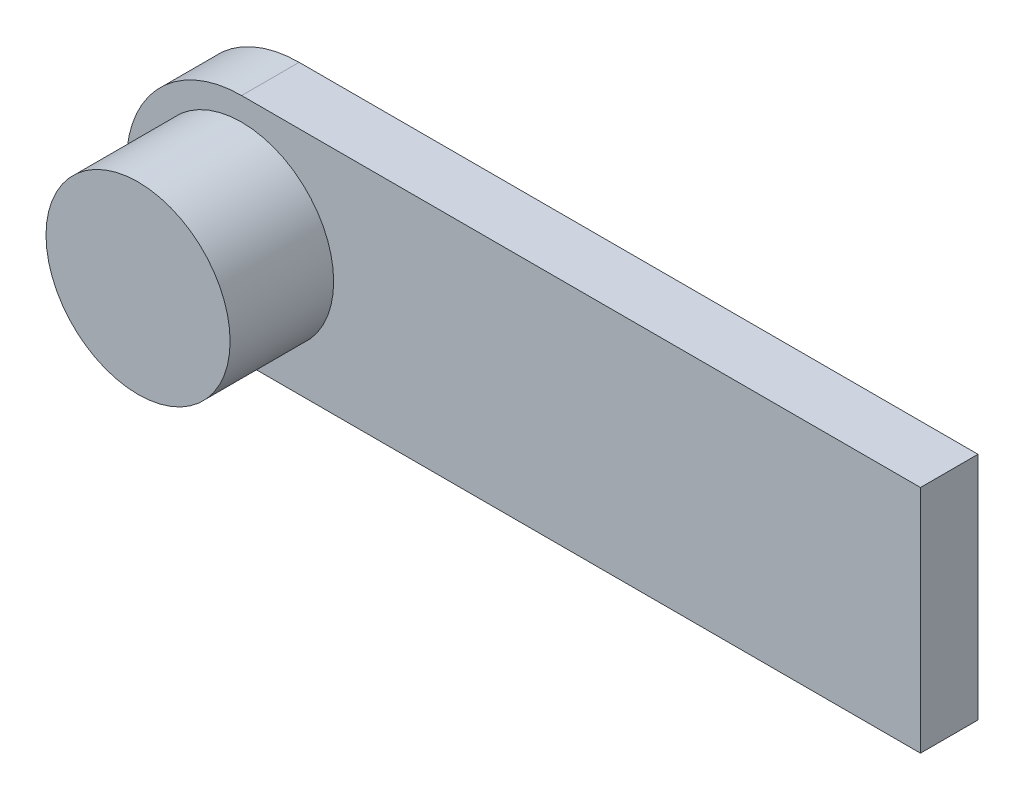
ISO-10303-21;
HEADER;
FILE_DESCRIPTION(('STEP AP214'),'2;1');
FILE_NAME('part.step','',(''),(''),'','','');
FILE_SCHEMA(('AUTOMOTIVE_DESIGN { 1 0 10303 214 1 1 1 1 }'));
ENDSEC;
DATA;
#1=APPLICATION_CONTEXT('core data for automotive mechanical design processes');
#2=APPLICATION_PROTOCOL_DEFINITION('international standard','automotive_design',2000,#1);
#3=PRODUCT_CONTEXT('',#1,'mechanical');
#4=PRODUCT('Part','Part','',(#3));
#5=PRODUCT_RELATED_PRODUCT_CATEGORY('part','',(#4));
#6=PRODUCT_DEFINITION_FORMATION('','',#4);
#7=PRODUCT_DEFINITION_CONTEXT('part definition',#1,'design');
#8=PRODUCT_DEFINITION('design','',#6,#7);
#9=PRODUCT_DEFINITION_SHAPE('','',#8);
#10=(LENGTH_UNIT() NAMED_UNIT(*) SI_UNIT(.MILLI.,.METRE.));
#11=(NAMED_UNIT(*) PLANE_ANGLE_UNIT() SI_UNIT($,.RADIAN.));
#12=(NAMED_UNIT(*) SI_UNIT($,.STERADIAN.) SOLID_ANGLE_UNIT());
#13=UNCERTAINTY_MEASURE_WITH_UNIT(LENGTH_MEASURE(1.E-05),#10,'distance_accuracy_value','');
#14=(GEOMETRIC_REPRESENTATION_CONTEXT(3) GLOBAL_UNCERTAINTY_ASSIGNED_CONTEXT((#13)) GLOBAL_UNIT_ASSIGNED_CONTEXT((#10,
#11,#12)) REPRESENTATION_CONTEXT('',''));
#15=CARTESIAN_POINT('',(0.,0.,0.));
#16=DIRECTION('',(0.,0.,1.));
#17=DIRECTION('',(1.,0.,0.));
#18=AXIS2_PLACEMENT_3D('',#15,#16,#17);
#19=CARTESIAN_POINT('',(0.,0.,0.25));
#20=DIRECTION('',(0.,0.,1.));
#21=DIRECTION('',(0.707106781186548,0.707106781186548,0.));
#22=AXIS2_PLACEMENT_3D('',#19,#20,#21);
#23=PLANE('',#22);
#24=DIRECTION('',(0.,1.,0.));
#25=VECTOR('',#24,1.);
#26=CARTESIAN_POINT('',(8.45,-0.5,0.25));
#27=LINE('',#26,#25);
#28=CARTESIAN_POINT('',(8.45,-0.5,0.25));
#29=VERTEX_POINT('',#28);
#30=CARTESIAN_POINT('',(8.45,0.5,0.25));
#31=VERTEX_POINT('',#30);
#32=EDGE_CURVE('E11',#29,#31,#27,.T.);
#33=ORIENTED_EDGE('',*,*,#32,.T.);
#34=DIRECTION('',(-1.,0.,0.));
#35=VECTOR('',#34,1.);
#36=CARTESIAN_POINT('',(8.45,0.5,0.25));
#37=LINE('',#36,#35);
#38=CARTESIAN_POINT('',(5.5,0.5,0.25));
#39=VERTEX_POINT('',#38);
#40=EDGE_CURVE('E26',#31,#39,#37,.T.);
#41=ORIENTED_EDGE('',*,*,#40,.T.);
#42=CARTESIAN_POINT('',(5.5,0.,0.25));
#43=DIRECTION('',(0.,0.,1.));
#44=DIRECTION('',(0.,1.,0.));
#45=AXIS2_PLACEMENT_3D('',#42,#43,#44);
#46=CIRCLE('',#45,0.5);
#47=CARTESIAN_POINT('',(5.5,-0.5,0.25));
#48=VERTEX_POINT('',#47);
#49=EDGE_CURVE('E104',#39,#48,#46,.T.);
#50=ORIENTED_EDGE('',*,*,#49,.T.);
#51=DIRECTION('',(1.,0.,0.));
#52=VECTOR('',#51,1.);
#53=CARTESIAN_POINT('',(5.5,-0.5,0.25));
#54=LINE('',#53,#52);
#55=EDGE_CURVE('E75',#48,#29,#54,.T.);
#56=ORIENTED_EDGE('',*,*,#55,.T.);
#57=EDGE_LOOP('',(#33,#41,#50,#56));
#58=FACE_BOUND('',#57,.T.);
#59=CARTESIAN_POINT('',(5.5,0.,0.25));
#60=DIRECTION('',(0.,0.,1.));
#61=DIRECTION('',(1.,0.,0.));
#62=AXIS2_PLACEMENT_3D('',#59,#60,#61);
#63=CIRCLE('',#62,0.4);
#64=CARTESIAN_POINT('',(5.9,0.,0.25));
#65=VERTEX_POINT('',#64);
#66=EDGE_CURVE('E66',#65,#65,#63,.T.);
#67=ORIENTED_EDGE('',*,*,#66,.F.);
#68=EDGE_LOOP('',(#67));
#69=FACE_BOUND('',#68,.T.);
#70=ADVANCED_FACE('F16',(#58,#69),#23,.T.);
#71=CARTESIAN_POINT('',(8.45,-0.5,0.));
#72=DIRECTION('',(1.,0.,0.));
#73=DIRECTION('',(0.,0.707106781186548,0.707106781186548));
#74=AXIS2_PLACEMENT_3D('',#71,#72,#73);
#75=PLANE('',#74);
#76=DIRECTION('',(0.,1.,0.));
#77=VECTOR('',#76,1.);
#78=CARTESIAN_POINT('',(8.45,-0.5,0.));
#79=LINE('',#78,#77);
#80=CARTESIAN_POINT('',(8.45,-0.5,0.));
#81=VERTEX_POINT('',#80);
#82=CARTESIAN_POINT('',(8.45,0.5,0.));
#83=VERTEX_POINT('',#82);
#84=EDGE_CURVE('E77',#81,#83,#79,.T.);
#85=ORIENTED_EDGE('',*,*,#84,.T.);
#86=DIRECTION('',(0.,0.,1.));
#87=VECTOR('',#86,1.);
#88=CARTESIAN_POINT('',(8.45,0.5,0.));
#89=LINE('',#88,#87);
#90=EDGE_CURVE('E80',#83,#31,#89,.T.);
#91=ORIENTED_EDGE('',*,*,#90,.T.);
#92=ORIENTED_EDGE('',*,*,#32,.F.);
#93=DIRECTION('',(0.,0.,1.));
#94=VECTOR('',#93,1.);
#95=CARTESIAN_POINT('',(8.45,-0.5,0.));
#96=LINE('',#95,#94);
#97=EDGE_CURVE('E68',#81,#29,#96,.T.);
#98=ORIENTED_EDGE('',*,*,#97,.F.);
#99=EDGE_LOOP('',(#85,#91,#92,#98));
#100=FACE_BOUND('',#99,.T.);
#101=ADVANCED_FACE('F98',(#100),#75,.T.);
#102=CARTESIAN_POINT('',(8.45,0.5,0.));
#103=DIRECTION('',(0.,1.,0.));
#104=DIRECTION('',(0.707106781186548,0.,0.707106781186548));
#105=AXIS2_PLACEMENT_3D('',#102,#103,#104);
#106=PLANE('',#105);
#107=DIRECTION('',(-1.,0.,0.));
#108=VECTOR('',#107,1.);
#109=CARTESIAN_POINT('',(8.45,0.5,0.));
#110=LINE('',#109,#108);
#111=CARTESIAN_POINT('',(5.5,0.5,0.));
#112=VERTEX_POINT('',#111);
#113=EDGE_CURVE('E82',#83,#112,#110,.T.);
#114=ORIENTED_EDGE('',*,*,#113,.T.);
#115=DIRECTION('',(0.,0.,1.));
#116=VECTOR('',#115,1.);
#117=CARTESIAN_POINT('',(5.5,0.5,0.));
#118=LINE('',#117,#116);
#119=EDGE_CURVE('E86',#112,#39,#118,.T.);
#120=ORIENTED_EDGE('',*,*,#119,.T.);
#121=ORIENTED_EDGE('',*,*,#40,.F.);
#122=ORIENTED_EDGE('',*,*,#90,.F.);
#123=EDGE_LOOP('',(#114,#120,#121,#122));
#124=FACE_BOUND('',#123,.T.);
#125=ADVANCED_FACE('F108',(#124),#106,.T.);
#126=CARTESIAN_POINT('',(5.5,0.,0.));
#127=DIRECTION('',(0.,0.,1.));
#128=DIRECTION('',(0.,1.,0.));
#129=AXIS2_PLACEMENT_3D('',#126,#127,#128);
#130=CYLINDRICAL_SURFACE('',#129,0.5);
#131=CARTESIAN_POINT('',(5.5,0.,0.));
#132=DIRECTION('',(0.,0.,1.));
#133=DIRECTION('',(0.,1.,0.));
#134=AXIS2_PLACEMENT_3D('',#131,#132,#133);
#135=CIRCLE('',#134,0.5);
#136=CARTESIAN_POINT('',(5.5,-0.5,0.));
#137=VERTEX_POINT('',#136);
#138=EDGE_CURVE('E88',#112,#137,#135,.T.);
#139=ORIENTED_EDGE('',*,*,#138,.T.);
#140=DIRECTION('',(0.,0.,1.));
#141=VECTOR('',#140,1.);
#142=CARTESIAN_POINT('',(5.5,-0.5,0.));
#143=LINE('',#142,#141);
#144=EDGE_CURVE('E58',#137,#48,#143,.T.);
#145=ORIENTED_EDGE('',*,*,#144,.T.);
#146=ORIENTED_EDGE('',*,*,#49,.F.);
#147=ORIENTED_EDGE('',*,*,#119,.F.);
#148=EDGE_LOOP('',(#139,#145,#146,#147));
#149=FACE_BOUND('',#148,.T.);
#150=ADVANCED_FACE('F107',(#149),#130,.T.);
#151=CARTESIAN_POINT('',(5.5,-0.5,0.));
#152=DIRECTION('',(0.,-1.,0.));
#153=DIRECTION('',(0.707106781186548,0.,0.707106781186548));
#154=AXIS2_PLACEMENT_3D('',#151,#152,#153);
#155=PLANE('',#154);
#156=DIRECTION('',(1.,0.,0.));
#157=VECTOR('',#156,1.);
#158=CARTESIAN_POINT('',(5.5,-0.5,0.));
#159=LINE('',#158,#157);
#160=EDGE_CURVE('E71',#137,#81,#159,.T.);
#161=ORIENTED_EDGE('',*,*,#160,.T.);
#162=ORIENTED_EDGE('',*,*,#97,.T.);
#163=ORIENTED_EDGE('',*,*,#55,.F.);
#164=ORIENTED_EDGE('',*,*,#144,.F.);
#165=EDGE_LOOP('',(#161,#162,#163,#164));
#166=FACE_BOUND('',#165,.T.);
#167=ADVANCED_FACE('F91',(#166),#155,.T.);
#168=CARTESIAN_POINT('',(5.5,0.,0.25));
#169=DIRECTION('',(0.,0.,1.));
#170=DIRECTION('',(1.,0.,0.));
#171=AXIS2_PLACEMENT_3D('',#168,#169,#170);
#172=CYLINDRICAL_SURFACE('',#171,0.4);
#173=CARTESIAN_POINT('',(5.5,0.,0.7));
#174=DIRECTION('',(0.,0.,1.));
#175=DIRECTION('',(1.,0.,0.));
#176=AXIS2_PLACEMENT_3D('',#173,#174,#175);
#177=CIRCLE('',#176,0.4);
#178=CARTESIAN_POINT('',(5.9,0.,0.7));
#179=VERTEX_POINT('',#178);
#180=EDGE_CURVE('E20',#179,#179,#177,.T.);
#181=ORIENTED_EDGE('',*,*,#180,.F.);
#182=EDGE_LOOP('',(#181));
#183=FACE_BOUND('',#182,.T.);
#184=ORIENTED_EDGE('',*,*,#66,.T.);
#185=EDGE_LOOP('',(#184));
#186=FACE_BOUND('',#185,.T.);
#187=ADVANCED_FACE('F63',(#183,#186),#172,.T.);
#188=CARTESIAN_POINT('',(0.,0.,0.));
#189=DIRECTION('',(0.,0.,1.));
#190=DIRECTION('',(0.707106781186548,0.707106781186548,0.));
#191=AXIS2_PLACEMENT_3D('',#188,#189,#190);
#192=PLANE('',#191);
#193=ORIENTED_EDGE('',*,*,#160,.F.);
#194=ORIENTED_EDGE('',*,*,#138,.F.);
#195=ORIENTED_EDGE('',*,*,#113,.F.);
#196=ORIENTED_EDGE('',*,*,#84,.F.);
#197=EDGE_LOOP('',(#193,#194,#195,#196));
#198=FACE_BOUND('',#197,.T.);
#199=ADVANCED_FACE('F95',(#198),#192,.F.);
#200=CARTESIAN_POINT('',(3.45,0.,0.7));
#201=DIRECTION('',(0.,0.,-1.));
#202=DIRECTION('',(0.707106781186548,0.707106781186548,0.));
#203=AXIS2_PLACEMENT_3D('',#200,#201,#202);
#204=PLANE('',#203);
#205=ORIENTED_EDGE('',*,*,#180,.T.);
#206=EDGE_LOOP('',(#205));
#207=FACE_BOUND('',#206,.T.);
#208=ADVANCED_FACE('F18',(#207),#204,.F.);
#209=CLOSED_SHELL('',(#70,#101,#125,#150,#167,#187,#199,#208));
#210=MANIFOLD_SOLID_BREP('B1',#209);
#211=ADVANCED_BREP_SHAPE_REPRESENTATION('',(#18,#210),#14);
#212=SHAPE_DEFINITION_REPRESENTATION(#9,#211);
ENDSEC;
END-ISO-10303-21;
